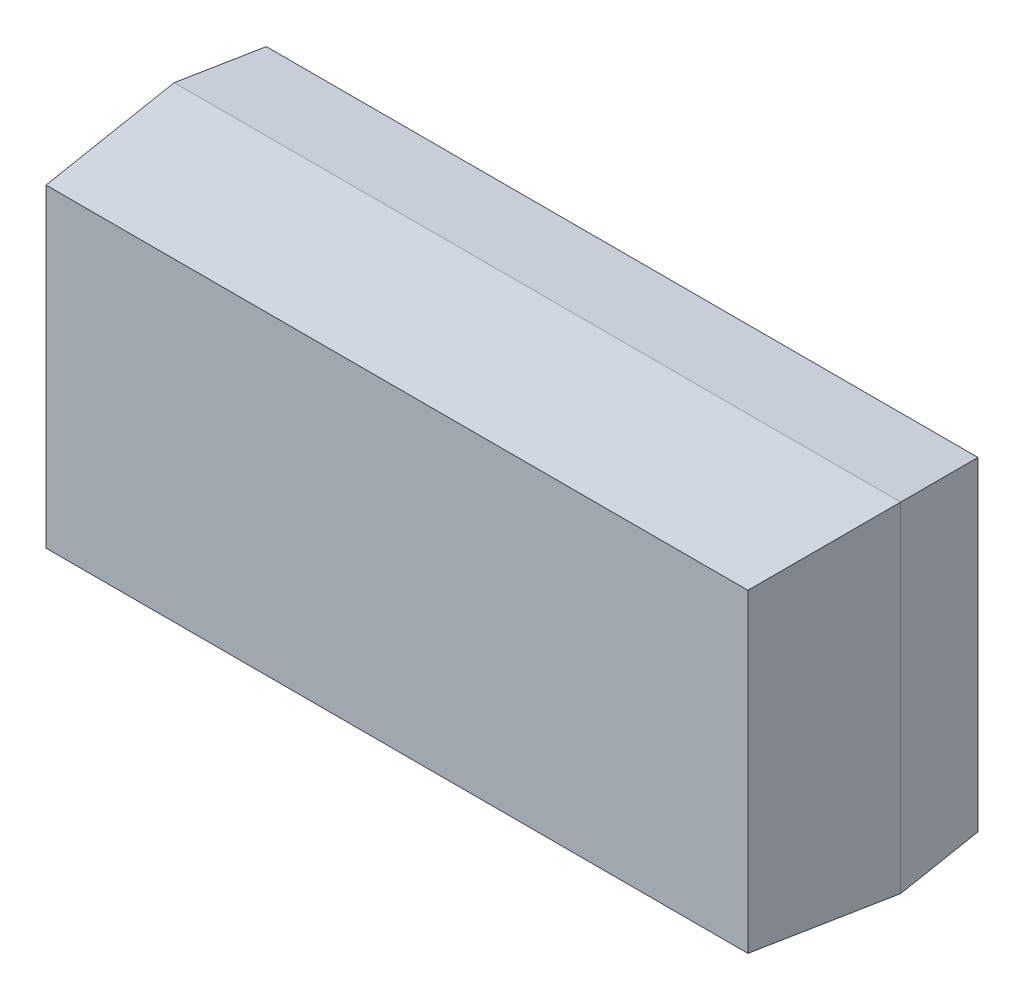
ISO-10303-21;
HEADER;
FILE_DESCRIPTION(('STEP AP214'),'2;1');
FILE_NAME('part.step','',(''),(''),'','','');
FILE_SCHEMA(('AUTOMOTIVE_DESIGN { 1 0 10303 214 1 1 1 1 }'));
ENDSEC;
DATA;
#1=APPLICATION_CONTEXT('core data for automotive mechanical design processes');
#2=APPLICATION_PROTOCOL_DEFINITION('international standard','automotive_design',2000,#1);
#3=PRODUCT_CONTEXT('',#1,'mechanical');
#4=PRODUCT('Part','Part','',(#3));
#5=PRODUCT_RELATED_PRODUCT_CATEGORY('part','',(#4));
#6=PRODUCT_DEFINITION_FORMATION('','',#4);
#7=PRODUCT_DEFINITION_CONTEXT('part definition',#1,'design');
#8=PRODUCT_DEFINITION('design','',#6,#7);
#9=PRODUCT_DEFINITION_SHAPE('','',#8);
#10=(LENGTH_UNIT() NAMED_UNIT(*) SI_UNIT(.MILLI.,.METRE.));
#11=(NAMED_UNIT(*) PLANE_ANGLE_UNIT() SI_UNIT($,.RADIAN.));
#12=(NAMED_UNIT(*) SI_UNIT($,.STERADIAN.) SOLID_ANGLE_UNIT());
#13=UNCERTAINTY_MEASURE_WITH_UNIT(LENGTH_MEASURE(1.E-05),#10,'distance_accuracy_value','');
#14=(GEOMETRIC_REPRESENTATION_CONTEXT(3) GLOBAL_UNCERTAINTY_ASSIGNED_CONTEXT((#13)) GLOBAL_UNIT_ASSIGNED_CONTEXT((#10,
#11,#12)) REPRESENTATION_CONTEXT('',''));
#15=CARTESIAN_POINT('',(0.,0.,0.));
#16=DIRECTION('',(0.,0.,1.));
#17=DIRECTION('',(1.,0.,0.));
#18=AXIS2_PLACEMENT_3D('',#15,#16,#17);
#19=CARTESIAN_POINT('',(-1.30367873042464,-0.477301685692797,0.109451736155931));
#20=DIRECTION('',(0.,0.,-1.));
#21=DIRECTION('',(0.,1.,0.));
#22=AXIS2_PLACEMENT_3D('',#19,#20,#21);
#23=PLANE('',#22);
#24=DIRECTION('',(0.,1.,0.));
#25=VECTOR('',#24,1.);
#26=CARTESIAN_POINT('',(-1.18385830491971,-0.418869314327818,0.109451736155931));
#27=LINE('',#26,#25);
#28=CARTESIAN_POINT('',(-1.18385830491971,-0.474745557444155,0.109451736155931));
#29=VERTEX_POINT('',#28);
#30=CARTESIAN_POINT('',(-1.18385830491971,-0.423622992471322,0.109451736155931));
#31=VERTEX_POINT('',#30);
#32=EDGE_CURVE('E89',#29,#31,#27,.T.);
#33=ORIENTED_EDGE('',*,*,#32,.T.);
#34=DIRECTION('',(1.,0.,0.));
#35=VECTOR('',#34,1.);
#36=CARTESIAN_POINT('',(-1.30587628031951,-0.423622992471322,0.109451736155931));
#37=LINE('',#36,#35);
#38=CARTESIAN_POINT('',(-1.29797299587679,-0.423622992471322,0.109451736155931));
#39=VERTEX_POINT('',#38);
#40=EDGE_CURVE('E71',#31,#39,#37,.F.);
#41=ORIENTED_EDGE('',*,*,#40,.T.);
#42=DIRECTION('',(0.,1.,0.));
#43=VECTOR('',#42,1.);
#44=CARTESIAN_POINT('',(-1.29797299587679,-0.418869314327818,0.109451736155931));
#45=LINE('',#44,#43);
#46=CARTESIAN_POINT('',(-1.29797299587679,-0.474745557444155,0.109451736155931));
#47=VERTEX_POINT('',#46);
#48=EDGE_CURVE('E20',#39,#47,#45,.F.);
#49=ORIENTED_EDGE('',*,*,#48,.T.);
#50=DIRECTION('',(1.,0.,0.));
#51=VECTOR('',#50,1.);
#52=CARTESIAN_POINT('',(-1.30587628031951,-0.474745557444155,0.109451736155931));
#53=LINE('',#52,#51);
#54=EDGE_CURVE('E67',#47,#29,#53,.T.);
#55=ORIENTED_EDGE('',*,*,#54,.T.);
#56=EDGE_LOOP('',(#33,#41,#49,#55));
#57=FACE_BOUND('',#56,.T.);
#58=ADVANCED_FACE('F17',(#57),#23,.F.);
#59=CARTESIAN_POINT('',(-1.30007065714007,-0.418869314327818,0.0854753582031754));
#60=DIRECTION('',(0.996194698091746,0.,-0.0871557427476491));
#61=DIRECTION('',(-0.0871557427476491,0.,-0.996194698091746));
#62=AXIS2_PLACEMENT_3D('',#59,#60,#61);
#63=PLANE('',#62);
#64=DIRECTION('',(0.0868265938640655,0.0868265938642422,0.992432509138983));
#65=VECTOR('',#64,1.);
#66=CARTESIAN_POINT('',(-1.29997076850848,-0.476743330075849,0.08661709048664));
#67=LINE('',#66,#65);
#68=CARTESIAN_POINT('',(-1.29997076850848,-0.476743330075849,0.0866170904866401));
#69=VERTEX_POINT('',#68);
#70=EDGE_CURVE('E76',#69,#47,#67,.T.);
#71=ORIENTED_EDGE('',*,*,#70,.T.);
#72=ORIENTED_EDGE('',*,*,#48,.F.);
#73=DIRECTION('',(-0.0868265938640658,0.0868265938642024,-0.992432509138987));
#74=VECTOR('',#73,1.);
#75=CARTESIAN_POINT('',(-1.29797299587679,-0.423622992471322,0.109451736155931));
#76=LINE('',#75,#74);
#77=CARTESIAN_POINT('',(-1.29997076850848,-0.421625219839629,0.0866170904866401));
#78=VERTEX_POINT('',#77);
#79=EDGE_CURVE('E91',#39,#78,#76,.T.);
#80=ORIENTED_EDGE('',*,*,#79,.T.);
#81=DIRECTION('',(0.,1.,0.));
#82=VECTOR('',#81,1.);
#83=CARTESIAN_POINT('',(-1.29997076850849,-0.418869314327818,0.0866170904866393));
#84=LINE('',#83,#82);
#85=EDGE_CURVE('E85',#78,#69,#84,.F.);
#86=ORIENTED_EDGE('',*,*,#85,.T.);
#87=EDGE_LOOP('',(#71,#72,#80,#86));
#88=FACE_BOUND('',#87,.T.);
#89=ADVANCED_FACE('F84',(#88),#63,.F.);
#90=CARTESIAN_POINT('',(-1.30587628031951,-0.476843218707434,0.0854753582031754));
#91=DIRECTION('',(0.,0.996194698091746,-0.087155742747651));
#92=DIRECTION('',(0.,0.087155742747651,0.996194698091746));
#93=AXIS2_PLACEMENT_3D('',#90,#91,#92);
#94=PLANE('',#93);
#95=DIRECTION('',(-0.0868265938642412,0.0868265938642365,0.992432509138969));
#96=VECTOR('',#95,1.);
#97=CARTESIAN_POINT('',(-1.18186053228801,-0.476743330075849,0.0866170904866399));
#98=LINE('',#97,#96);
#99=CARTESIAN_POINT('',(-1.18186053228801,-0.476743330075849,0.08661709048664));
#100=VERTEX_POINT('',#99);
#101=EDGE_CURVE('E82',#100,#29,#98,.T.);
#102=ORIENTED_EDGE('',*,*,#101,.T.);
#103=ORIENTED_EDGE('',*,*,#54,.F.);
#104=ORIENTED_EDGE('',*,*,#70,.F.);
#105=DIRECTION('',(1.,0.,0.));
#106=VECTOR('',#105,1.);
#107=CARTESIAN_POINT('',(-1.30587628031951,-0.476743330075849,0.08661709048664));
#108=LINE('',#107,#106);
#109=EDGE_CURVE('E101',#69,#100,#108,.T.);
#110=ORIENTED_EDGE('',*,*,#109,.T.);
#111=EDGE_LOOP('',(#102,#103,#104,#110));
#112=FACE_BOUND('',#111,.T.);
#113=ADVANCED_FACE('F79',(#112),#94,.F.);
#114=CARTESIAN_POINT('',(-1.18395819355129,-0.418869314327818,0.110593468439396));
#115=DIRECTION('',(-0.996194698091746,0.,-0.0871557427476518));
#116=DIRECTION('',(-0.0871557427476518,0.,0.996194698091746));
#117=AXIS2_PLACEMENT_3D('',#114,#115,#116);
#118=PLANE('',#117);
#119=ORIENTED_EDGE('',*,*,#101,.F.);
#120=DIRECTION('',(0.,1.,0.));
#121=VECTOR('',#120,1.);
#122=CARTESIAN_POINT('',(-1.18186053228801,-0.418869314327818,0.0866170904866398));
#123=LINE('',#122,#121);
#124=CARTESIAN_POINT('',(-1.18186053228801,-0.421625219839629,0.0866170904866399));
#125=VERTEX_POINT('',#124);
#126=EDGE_CURVE('E106',#100,#125,#123,.T.);
#127=ORIENTED_EDGE('',*,*,#126,.T.);
#128=DIRECTION('',(-0.086826593864496,-0.0868265938641992,0.99243250913895));
#129=VECTOR('',#128,1.);
#130=CARTESIAN_POINT('',(-1.18186053228801,-0.421625219839629,0.08661709048664));
#131=LINE('',#130,#129);
#132=EDGE_CURVE('E93',#125,#31,#131,.T.);
#133=ORIENTED_EDGE('',*,*,#132,.T.);
#134=ORIENTED_EDGE('',*,*,#32,.F.);
#135=EDGE_LOOP('',(#119,#127,#133,#134));
#136=FACE_BOUND('',#135,.T.);
#137=ADVANCED_FACE('F153',(#136),#118,.F.);
#138=CARTESIAN_POINT('',(-1.30587628031951,-0.423722881102907,0.110593468439396));
#139=DIRECTION('',(0.,-0.99619469809175,-0.0871557427476112));
#140=DIRECTION('',(0.,0.0871557427476112,-0.99619469809175));
#141=AXIS2_PLACEMENT_3D('',#138,#139,#140);
#142=PLANE('',#141);
#143=ORIENTED_EDGE('',*,*,#132,.F.);
#144=DIRECTION('',(1.,0.,0.));
#145=VECTOR('',#144,1.);
#146=CARTESIAN_POINT('',(-1.30587628031951,-0.421625219839629,0.08661709048664));
#147=LINE('',#146,#145);
#148=EDGE_CURVE('E113',#125,#78,#147,.F.);
#149=ORIENTED_EDGE('',*,*,#148,.T.);
#150=ORIENTED_EDGE('',*,*,#79,.F.);
#151=ORIENTED_EDGE('',*,*,#40,.F.);
#152=EDGE_LOOP('',(#143,#149,#150,#151));
#153=FACE_BOUND('',#152,.T.);
#154=ADVANCED_FACE('F150',(#153),#142,.F.);
#155=CARTESIAN_POINT('',(-1.29870493843582,-0.418869314327818,0.072148586549632));
#156=DIRECTION('',(0.996194698091747,0.,0.0871557427476422));
#157=DIRECTION('',(0.0871557427476422,0.,-0.996194698091747));
#158=AXIS2_PLACEMENT_3D('',#155,#156,#157);
#159=PLANE('',#158);
#160=DIRECTION('',(-0.0868265938642247,-0.0868265938642403,0.99243250913897));
#161=VECTOR('',#160,1.);
#162=CARTESIAN_POINT('',(-1.29876521605832,-0.475537777625689,0.0728375629275848));
#163=LINE('',#162,#161);
#164=CARTESIAN_POINT('',(-1.29876521605832,-0.475537777625689,0.0728375629275844));
#165=VERTEX_POINT('',#164);
#166=EDGE_CURVE('E98',#165,#69,#163,.T.);
#167=ORIENTED_EDGE('',*,*,#166,.T.);
#168=ORIENTED_EDGE('',*,*,#85,.F.);
#169=DIRECTION('',(0.0868265938642241,-0.08682659386431,-0.992432509138964));
#170=VECTOR('',#169,1.);
#171=CARTESIAN_POINT('',(-1.29997076850848,-0.421625219839629,0.08661709048664));
#172=LINE('',#171,#170);
#173=CARTESIAN_POINT('',(-1.29876521605832,-0.42283077228979,0.0728375629275844));
#174=VERTEX_POINT('',#173);
#175=EDGE_CURVE('E109',#78,#174,#172,.T.);
#176=ORIENTED_EDGE('',*,*,#175,.T.);
#177=DIRECTION('',(0.,-1.,0.));
#178=VECTOR('',#177,1.);
#179=CARTESIAN_POINT('',(-1.29876521605832,-0.420195422022995,0.0728375629275848));
#180=LINE('',#179,#178);
#181=EDGE_CURVE('E116',#174,#165,#180,.T.);
#182=ORIENTED_EDGE('',*,*,#181,.T.);
#183=EDGE_LOOP('',(#167,#168,#176,#182));
#184=FACE_BOUND('',#183,.T.);
#185=ADVANCED_FACE('F133',(#184),#159,.F.);
#186=CARTESIAN_POINT('',(-1.30587628031951,-0.475477500003181,0.072148586549632));
#187=DIRECTION('',(0.,0.996194698091746,0.0871557427476517));
#188=DIRECTION('',(0.,-0.0871557427476517,0.996194698091746));
#189=AXIS2_PLACEMENT_3D('',#186,#187,#188);
#190=PLANE('',#189);
#191=ORIENTED_EDGE('',*,*,#166,.F.);
#192=DIRECTION('',(1.,0.,0.));
#193=VECTOR('',#192,1.);
#194=CARTESIAN_POINT('',(-1.30455017262433,-0.475537777625689,0.0728375629275848));
#195=LINE('',#194,#193);
#196=CARTESIAN_POINT('',(-1.18306608473817,-0.475537777625689,0.0728375629275848));
#197=VERTEX_POINT('',#196);
#198=EDGE_CURVE('E119',#165,#197,#195,.T.);
#199=ORIENTED_EDGE('',*,*,#198,.T.);
#200=DIRECTION('',(0.0868265938642401,-0.0868265938642245,0.99243250913897));
#201=VECTOR('',#200,1.);
#202=CARTESIAN_POINT('',(-1.18306608473817,-0.475537777625689,0.0728375629275846));
#203=LINE('',#202,#201);
#204=EDGE_CURVE('E103',#197,#100,#203,.T.);
#205=ORIENTED_EDGE('',*,*,#204,.T.);
#206=ORIENTED_EDGE('',*,*,#109,.F.);
#207=EDGE_LOOP('',(#191,#199,#205,#206));
#208=FACE_BOUND('',#207,.T.);
#209=ADVANCED_FACE('F131',(#208),#190,.F.);
#210=CARTESIAN_POINT('',(-1.1818002546655,-0.418869314327818,0.0873060668645927));
#211=DIRECTION('',(-0.996194698091747,0.,0.0871557427476418));
#212=DIRECTION('',(0.0871557427476418,0.,0.996194698091747));
#213=AXIS2_PLACEMENT_3D('',#210,#211,#212);
#214=PLANE('',#213);
#215=ORIENTED_EDGE('',*,*,#204,.F.);
#216=DIRECTION('',(0.,-1.,0.));
#217=VECTOR('',#216,1.);
#218=CARTESIAN_POINT('',(-1.18306608473817,-0.420195422022995,0.0728375629275848));
#219=LINE('',#218,#217);
#220=CARTESIAN_POINT('',(-1.18306608473817,-0.42283077228979,0.0728375629275847));
#221=VERTEX_POINT('',#220);
#222=EDGE_CURVE('E26',#197,#221,#219,.F.);
#223=ORIENTED_EDGE('',*,*,#222,.T.);
#224=DIRECTION('',(0.0868265938642241,0.08682659386431,0.992432509138964));
#225=VECTOR('',#224,1.);
#226=CARTESIAN_POINT('',(-1.18306608473817,-0.42283077228979,0.0728375629275848));
#227=LINE('',#226,#225);
#228=EDGE_CURVE('E34',#221,#125,#227,.T.);
#229=ORIENTED_EDGE('',*,*,#228,.T.);
#230=ORIENTED_EDGE('',*,*,#126,.F.);
#231=EDGE_LOOP('',(#215,#223,#229,#230));
#232=FACE_BOUND('',#231,.T.);
#233=ADVANCED_FACE('F125',(#232),#214,.F.);
#234=CARTESIAN_POINT('',(-1.30587628031951,-0.421564942217121,0.0873060668645927));
#235=DIRECTION('',(0.,-0.99619469809174,0.0871557427477216));
#236=DIRECTION('',(0.,-0.0871557427477216,-0.99619469809174));
#237=AXIS2_PLACEMENT_3D('',#234,#235,#236);
#238=PLANE('',#237);
#239=ORIENTED_EDGE('',*,*,#228,.F.);
#240=DIRECTION('',(1.,0.,0.));
#241=VECTOR('',#240,1.);
#242=CARTESIAN_POINT('',(-1.30455017262433,-0.42283077228979,0.0728375629275848));
#243=LINE('',#242,#241);
#244=EDGE_CURVE('E11',#221,#174,#243,.F.);
#245=ORIENTED_EDGE('',*,*,#244,.T.);
#246=ORIENTED_EDGE('',*,*,#175,.F.);
#247=ORIENTED_EDGE('',*,*,#148,.F.);
#248=EDGE_LOOP('',(#239,#245,#246,#247));
#249=FACE_BOUND('',#248,.T.);
#250=ADVANCED_FACE('F135',(#249),#238,.F.);
#251=CARTESIAN_POINT('',(-1.30455017262433,-0.420195422022995,0.0728375629275848));
#252=DIRECTION('',(0.,0.,1.));
#253=DIRECTION('',(0.,-1.,0.));
#254=AXIS2_PLACEMENT_3D('',#251,#252,#253);
#255=PLANE('',#254);
#256=ORIENTED_EDGE('',*,*,#222,.F.);
#257=ORIENTED_EDGE('',*,*,#198,.F.);
#258=ORIENTED_EDGE('',*,*,#181,.F.);
#259=ORIENTED_EDGE('',*,*,#244,.F.);
#260=EDGE_LOOP('',(#256,#257,#258,#259));
#261=FACE_BOUND('',#260,.T.);
#262=ADVANCED_FACE('F129',(#261),#255,.F.);
#263=CLOSED_SHELL('',(#58,#89,#113,#137,#154,#185,#209,#233,#250,#262));
#264=MANIFOLD_SOLID_BREP('B1',#263);
#265=ADVANCED_BREP_SHAPE_REPRESENTATION('',(#18,#264),#14);
#266=SHAPE_DEFINITION_REPRESENTATION(#9,#265);
ENDSEC;
END-ISO-10303-21;
